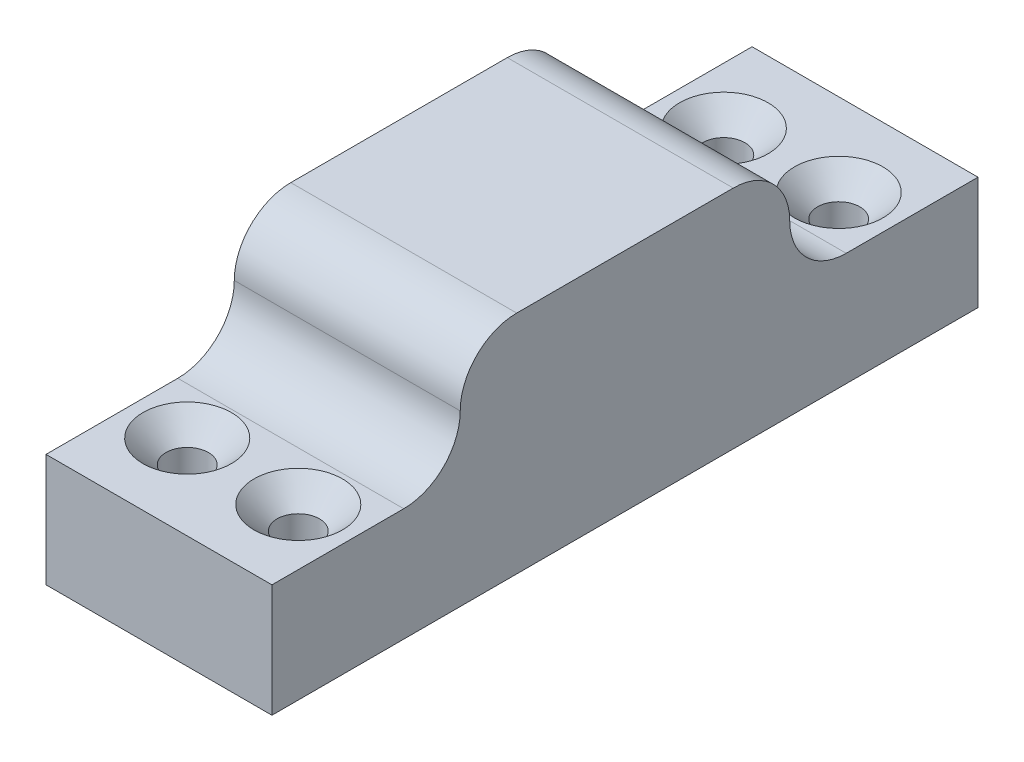
ISO-10303-21;
HEADER;
FILE_DESCRIPTION(('STEP AP214'),'2;1');
FILE_NAME('part.step','',(''),(''),'','','');
FILE_SCHEMA(('AUTOMOTIVE_DESIGN { 1 0 10303 214 1 1 1 1 }'));
ENDSEC;
DATA;
#1=APPLICATION_CONTEXT('core data for automotive mechanical design processes');
#2=APPLICATION_PROTOCOL_DEFINITION('international standard','automotive_design',2000,#1);
#3=PRODUCT_CONTEXT('',#1,'mechanical');
#4=PRODUCT('Part','Part','',(#3));
#5=PRODUCT_RELATED_PRODUCT_CATEGORY('part','',(#4));
#6=PRODUCT_DEFINITION_FORMATION('','',#4);
#7=PRODUCT_DEFINITION_CONTEXT('part definition',#1,'design');
#8=PRODUCT_DEFINITION('design','',#6,#7);
#9=PRODUCT_DEFINITION_SHAPE('','',#8);
#10=(LENGTH_UNIT() NAMED_UNIT(*) SI_UNIT(.MILLI.,.METRE.));
#11=(NAMED_UNIT(*) PLANE_ANGLE_UNIT() SI_UNIT($,.RADIAN.));
#12=(NAMED_UNIT(*) SI_UNIT($,.STERADIAN.) SOLID_ANGLE_UNIT());
#13=UNCERTAINTY_MEASURE_WITH_UNIT(LENGTH_MEASURE(1.E-05),#10,'distance_accuracy_value','');
#14=(GEOMETRIC_REPRESENTATION_CONTEXT(3) GLOBAL_UNCERTAINTY_ASSIGNED_CONTEXT((#13)) GLOBAL_UNIT_ASSIGNED_CONTEXT((#10,
#11,#12)) REPRESENTATION_CONTEXT('',''));
#15=CARTESIAN_POINT('',(0.,0.,0.));
#16=DIRECTION('',(0.,0.,1.));
#17=DIRECTION('',(1.,0.,0.));
#18=AXIS2_PLACEMENT_3D('',#15,#16,#17);
#19=CARTESIAN_POINT('',(24.,11.9999999999999,-37.4999999999996));
#20=DIRECTION('',(0.,0.,1.));
#21=DIRECTION('',(1.,0.,0.));
#22=AXIS2_PLACEMENT_3D('',#19,#20,#21);
#23=PLANE('',#22);
#24=DIRECTION('',(1.,0.,0.));
#25=VECTOR('',#24,1.);
#26=CARTESIAN_POINT('',(0.,-1.40512601554121E-13,-37.5000000000001));
#27=LINE('',#26,#25);
#28=CARTESIAN_POINT('',(0.,-1.40512601554121E-13,-37.5000000000001));
#29=VERTEX_POINT('',#28);
#30=CARTESIAN_POINT('',(24.,-1.40512601554121E-13,-37.5000000000001));
#31=VERTEX_POINT('',#30);
#32=EDGE_CURVE('E107',#29,#31,#27,.T.);
#33=ORIENTED_EDGE('',*,*,#32,.T.);
#34=DIRECTION('',(0.,1.,0.));
#35=VECTOR('',#34,1.);
#36=CARTESIAN_POINT('',(24.,11.9999999999999,-37.4999999999996));
#37=LINE('',#36,#35);
#38=CARTESIAN_POINT('',(24.,-12.0000000000001,-37.4999999999996));
#39=VERTEX_POINT('',#38);
#40=EDGE_CURVE('E211',#39,#31,#37,.T.);
#41=ORIENTED_EDGE('',*,*,#40,.F.);
#42=DIRECTION('',(-1.,0.,0.));
#43=VECTOR('',#42,1.);
#44=CARTESIAN_POINT('',(24.,-12.0000000000001,-37.4999999999996));
#45=LINE('',#44,#43);
#46=CARTESIAN_POINT('',(0.,-12.0000000000001,-37.4999999999996));
#47=VERTEX_POINT('',#46);
#48=EDGE_CURVE('E126',#39,#47,#45,.T.);
#49=ORIENTED_EDGE('',*,*,#48,.T.);
#50=DIRECTION('',(0.,1.,0.));
#51=VECTOR('',#50,1.);
#52=CARTESIAN_POINT('',(0.,11.9999999999999,-37.4999999999996));
#53=LINE('',#52,#51);
#54=EDGE_CURVE('E122',#47,#29,#53,.T.);
#55=ORIENTED_EDGE('',*,*,#54,.T.);
#56=EDGE_LOOP('',(#33,#41,#49,#55));
#57=FACE_BOUND('',#56,.T.);
#58=ADVANCED_FACE('F33',(#57),#23,.F.);
#59=CARTESIAN_POINT('',(24.,11.9999999999999,-37.4999999999996));
#60=DIRECTION('',(0.,-1.,0.));
#61=DIRECTION('',(0.,0.,-1.));
#62=AXIS2_PLACEMENT_3D('',#59,#60,#61);
#63=PLANE('',#62);
#64=DIRECTION('',(0.,0.,1.));
#65=VECTOR('',#64,1.);
#66=CARTESIAN_POINT('',(24.,11.9999999999999,-37.4999999999996));
#67=LINE('',#66,#65);
#68=CARTESIAN_POINT('',(24.,11.9999999999999,-11.5000000000001));
#69=VERTEX_POINT('',#68);
#70=CARTESIAN_POINT('',(24.,11.9999999999999,11.5000000000001));
#71=VERTEX_POINT('',#70);
#72=EDGE_CURVE('E138',#69,#71,#67,.T.);
#73=ORIENTED_EDGE('',*,*,#72,.F.);
#74=DIRECTION('',(1.,0.,0.));
#75=VECTOR('',#74,1.);
#76=CARTESIAN_POINT('',(0.,11.9999999999999,-11.5000000000001));
#77=LINE('',#76,#75);
#78=CARTESIAN_POINT('',(0.,11.9999999999999,-11.5000000000001));
#79=VERTEX_POINT('',#78);
#80=EDGE_CURVE('E162',#69,#79,#77,.F.);
#81=ORIENTED_EDGE('',*,*,#80,.T.);
#82=DIRECTION('',(0.,0.,1.));
#83=VECTOR('',#82,1.);
#84=CARTESIAN_POINT('',(0.,11.9999999999999,-37.4999999999996));
#85=LINE('',#84,#83);
#86=CARTESIAN_POINT('',(0.,11.9999999999999,11.5000000000001));
#87=VERTEX_POINT('',#86);
#88=EDGE_CURVE('E127',#79,#87,#85,.T.);
#89=ORIENTED_EDGE('',*,*,#88,.T.);
#90=DIRECTION('',(1.,0.,0.));
#91=VECTOR('',#90,1.);
#92=CARTESIAN_POINT('',(24.,11.9999999999999,11.5000000000001));
#93=LINE('',#92,#91);
#94=EDGE_CURVE('E141',#87,#71,#93,.T.);
#95=ORIENTED_EDGE('',*,*,#94,.T.);
#96=EDGE_LOOP('',(#73,#81,#89,#95));
#97=FACE_BOUND('',#96,.T.);
#98=ADVANCED_FACE('F181',(#97),#63,.F.);
#99=CARTESIAN_POINT('',(24.,0.,0.));
#100=DIRECTION('',(-1.,0.,0.));
#101=DIRECTION('',(0.,0.,1.));
#102=AXIS2_PLACEMENT_3D('',#99,#100,#101);
#103=PLANE('',#102);
#104=DIRECTION('',(0.,0.,1.));
#105=VECTOR('',#104,1.);
#106=CARTESIAN_POINT('',(24.,-1.40512601554121E-13,-37.5000000000001));
#107=LINE('',#106,#105);
#108=CARTESIAN_POINT('',(24.,0.,-23.5));
#109=VERTEX_POINT('',#108);
#110=EDGE_CURVE('E112',#31,#109,#107,.T.);
#111=ORIENTED_EDGE('',*,*,#110,.T.);
#112=CARTESIAN_POINT('',(24.,5.99999999999996,-23.5000000000001));
#113=DIRECTION('',(-1.,0.,0.));
#114=DIRECTION('',(0.,0.,1.));
#115=AXIS2_PLACEMENT_3D('',#112,#113,#114);
#116=CIRCLE('',#115,6.);
#117=CARTESIAN_POINT('',(24.,5.99999999999987,-17.5000000000001));
#118=VERTEX_POINT('',#117);
#119=EDGE_CURVE('E42',#109,#118,#116,.T.);
#120=ORIENTED_EDGE('',*,*,#119,.T.);
#121=CARTESIAN_POINT('',(24.,5.99999999999987,-11.5000000000001));
#122=DIRECTION('',(-1.,0.,0.));
#123=DIRECTION('',(0.,0.,1.));
#124=AXIS2_PLACEMENT_3D('',#121,#122,#123);
#125=CIRCLE('',#124,6.);
#126=EDGE_CURVE('E155',#118,#69,#125,.F.);
#127=ORIENTED_EDGE('',*,*,#126,.T.);
#128=ORIENTED_EDGE('',*,*,#72,.T.);
#129=CARTESIAN_POINT('',(24.,5.99999999999986,11.5000000000001));
#130=DIRECTION('',(-1.,0.,0.));
#131=DIRECTION('',(0.,0.,1.));
#132=AXIS2_PLACEMENT_3D('',#129,#130,#131);
#133=CIRCLE('',#132,6.);
#134=CARTESIAN_POINT('',(24.,5.99999999999986,17.5000000000001));
#135=VERTEX_POINT('',#134);
#136=EDGE_CURVE('E144',#71,#135,#133,.F.);
#137=ORIENTED_EDGE('',*,*,#136,.T.);
#138=CARTESIAN_POINT('',(24.,5.99999999999996,23.5000000000001));
#139=DIRECTION('',(-1.,0.,0.));
#140=DIRECTION('',(0.,0.,1.));
#141=AXIS2_PLACEMENT_3D('',#138,#139,#140);
#142=CIRCLE('',#141,6.);
#143=CARTESIAN_POINT('',(24.,0.,23.5));
#144=VERTEX_POINT('',#143);
#145=EDGE_CURVE('E151',#135,#144,#142,.T.);
#146=ORIENTED_EDGE('',*,*,#145,.T.);
#147=DIRECTION('',(0.,0.,-1.));
#148=VECTOR('',#147,1.);
#149=CARTESIAN_POINT('',(24.,-1.40512601554121E-13,37.5000000000001));
#150=LINE('',#149,#148);
#151=CARTESIAN_POINT('',(24.,-1.40512601554121E-13,37.5000000000001));
#152=VERTEX_POINT('',#151);
#153=EDGE_CURVE('E159',#152,#144,#150,.T.);
#154=ORIENTED_EDGE('',*,*,#153,.F.);
#155=DIRECTION('',(0.,-1.,0.));
#156=VECTOR('',#155,1.);
#157=CARTESIAN_POINT('',(24.,11.9999999999999,37.5000000000001));
#158=LINE('',#157,#156);
#159=CARTESIAN_POINT('',(24.,-12.0000000000001,37.5000000000001));
#160=VERTEX_POINT('',#159);
#161=EDGE_CURVE('E130',#152,#160,#158,.T.);
#162=ORIENTED_EDGE('',*,*,#161,.T.);
#163=DIRECTION('',(0.,0.,-1.));
#164=VECTOR('',#163,1.);
#165=CARTESIAN_POINT('',(24.,-12.0000000000001,-37.4999999999996));
#166=LINE('',#165,#164);
#167=EDGE_CURVE('E209',#160,#39,#166,.T.);
#168=ORIENTED_EDGE('',*,*,#167,.T.);
#169=ORIENTED_EDGE('',*,*,#40,.T.);
#170=EDGE_LOOP('',(#111,#120,#127,#128,#137,#146,#154,#162,#168,#169));
#171=FACE_BOUND('',#170,.T.);
#172=ADVANCED_FACE('F171',(#171),#103,.F.);
#173=CARTESIAN_POINT('',(0.,0.,0.));
#174=DIRECTION('',(-1.,0.,0.));
#175=DIRECTION('',(0.,0.,1.));
#176=AXIS2_PLACEMENT_3D('',#173,#174,#175);
#177=PLANE('',#176);
#178=ORIENTED_EDGE('',*,*,#88,.F.);
#179=CARTESIAN_POINT('',(0.,5.99999999999987,-11.5000000000001));
#180=DIRECTION('',(-1.,0.,0.));
#181=DIRECTION('',(0.,0.,1.));
#182=AXIS2_PLACEMENT_3D('',#179,#180,#181);
#183=CIRCLE('',#182,6.);
#184=CARTESIAN_POINT('',(0.,5.99999999999987,-17.5000000000001));
#185=VERTEX_POINT('',#184);
#186=EDGE_CURVE('E52',#79,#185,#183,.T.);
#187=ORIENTED_EDGE('',*,*,#186,.T.);
#188=CARTESIAN_POINT('',(0.,5.99999999999996,-23.5000000000001));
#189=DIRECTION('',(-1.,0.,0.));
#190=DIRECTION('',(0.,0.,1.));
#191=AXIS2_PLACEMENT_3D('',#188,#189,#190);
#192=CIRCLE('',#191,6.);
#193=CARTESIAN_POINT('',(0.,0.,-23.5));
#194=VERTEX_POINT('',#193);
#195=EDGE_CURVE('E11',#185,#194,#192,.F.);
#196=ORIENTED_EDGE('',*,*,#195,.T.);
#197=DIRECTION('',(0.,0.,1.));
#198=VECTOR('',#197,1.);
#199=CARTESIAN_POINT('',(0.,-1.40512601554121E-13,-37.5000000000001));
#200=LINE('',#199,#198);
#201=EDGE_CURVE('E109',#29,#194,#200,.T.);
#202=ORIENTED_EDGE('',*,*,#201,.F.);
#203=ORIENTED_EDGE('',*,*,#54,.F.);
#204=DIRECTION('',(0.,0.,-1.));
#205=VECTOR('',#204,1.);
#206=CARTESIAN_POINT('',(0.,-12.0000000000001,-37.4999999999996));
#207=LINE('',#206,#205);
#208=CARTESIAN_POINT('',(0.,-12.0000000000001,37.5000000000001));
#209=VERTEX_POINT('',#208);
#210=EDGE_CURVE('E128',#209,#47,#207,.T.);
#211=ORIENTED_EDGE('',*,*,#210,.F.);
#212=DIRECTION('',(0.,-1.,0.));
#213=VECTOR('',#212,1.);
#214=CARTESIAN_POINT('',(0.,11.9999999999999,37.5000000000001));
#215=LINE('',#214,#213);
#216=CARTESIAN_POINT('',(0.,-1.40512601554121E-13,37.5000000000001));
#217=VERTEX_POINT('',#216);
#218=EDGE_CURVE('E132',#217,#209,#215,.T.);
#219=ORIENTED_EDGE('',*,*,#218,.F.);
#220=DIRECTION('',(0.,0.,-1.));
#221=VECTOR('',#220,1.);
#222=CARTESIAN_POINT('',(0.,-1.40512601554121E-13,37.5000000000001));
#223=LINE('',#222,#221);
#224=CARTESIAN_POINT('',(0.,0.,23.5));
#225=VERTEX_POINT('',#224);
#226=EDGE_CURVE('E198',#217,#225,#223,.T.);
#227=ORIENTED_EDGE('',*,*,#226,.T.);
#228=CARTESIAN_POINT('',(0.,5.99999999999996,23.5000000000001));
#229=DIRECTION('',(-1.,0.,0.));
#230=DIRECTION('',(0.,0.,1.));
#231=AXIS2_PLACEMENT_3D('',#228,#229,#230);
#232=CIRCLE('',#231,6.);
#233=CARTESIAN_POINT('',(0.,5.99999999999986,17.5000000000001));
#234=VERTEX_POINT('',#233);
#235=EDGE_CURVE('E153',#225,#234,#232,.F.);
#236=ORIENTED_EDGE('',*,*,#235,.T.);
#237=CARTESIAN_POINT('',(0.,5.99999999999986,11.5000000000001));
#238=DIRECTION('',(-1.,0.,0.));
#239=DIRECTION('',(0.,0.,1.));
#240=AXIS2_PLACEMENT_3D('',#237,#238,#239);
#241=CIRCLE('',#240,6.);
#242=EDGE_CURVE('E146',#234,#87,#241,.T.);
#243=ORIENTED_EDGE('',*,*,#242,.T.);
#244=EDGE_LOOP('',(#178,#187,#196,#202,#203,#211,#219,#227,#236,#243));
#245=FACE_BOUND('',#244,.T.);
#246=ADVANCED_FACE('F120',(#245),#177,.T.);
#247=CARTESIAN_POINT('',(24.,11.9999999999999,37.5000000000001));
#248=DIRECTION('',(0.,0.,-1.));
#249=DIRECTION('',(-1.,0.,0.));
#250=AXIS2_PLACEMENT_3D('',#247,#248,#249);
#251=PLANE('',#250);
#252=ORIENTED_EDGE('',*,*,#161,.F.);
#253=DIRECTION('',(1.,0.,0.));
#254=VECTOR('',#253,1.);
#255=CARTESIAN_POINT('',(0.,-1.40512601554121E-13,37.5000000000001));
#256=LINE('',#255,#254);
#257=EDGE_CURVE('E201',#217,#152,#256,.T.);
#258=ORIENTED_EDGE('',*,*,#257,.F.);
#259=ORIENTED_EDGE('',*,*,#218,.T.);
#260=DIRECTION('',(-1.,0.,0.));
#261=VECTOR('',#260,1.);
#262=CARTESIAN_POINT('',(24.,-12.0000000000001,37.5000000000001));
#263=LINE('',#262,#261);
#264=EDGE_CURVE('E137',#160,#209,#263,.T.);
#265=ORIENTED_EDGE('',*,*,#264,.F.);
#266=EDGE_LOOP('',(#252,#258,#259,#265));
#267=FACE_BOUND('',#266,.T.);
#268=ADVANCED_FACE('F216',(#267),#251,.F.);
#269=CARTESIAN_POINT('',(24.,-12.0000000000001,-37.4999999999996));
#270=DIRECTION('',(0.,1.,0.));
#271=DIRECTION('',(0.,0.,1.));
#272=AXIS2_PLACEMENT_3D('',#269,#270,#271);
#273=PLANE('',#272);
#274=CARTESIAN_POINT('',(6.,-12.0000000000006,-28.5));
#275=DIRECTION('',(0.,1.,0.));
#276=DIRECTION('',(0.,0.,1.));
#277=AXIS2_PLACEMENT_3D('',#274,#275,#276);
#278=CIRCLE('',#277,2.25);
#279=CARTESIAN_POINT('',(6.,-12.0000000000006,-26.25));
#280=VERTEX_POINT('',#279);
#281=EDGE_CURVE('E287',#280,#280,#278,.T.);
#282=ORIENTED_EDGE('',*,*,#281,.T.);
#283=EDGE_LOOP('',(#282));
#284=FACE_BOUND('',#283,.T.);
#285=CARTESIAN_POINT('',(18.,-12.0000000000006,-28.7024893433951));
#286=DIRECTION('',(0.,1.,0.));
#287=DIRECTION('',(0.,0.,1.));
#288=AXIS2_PLACEMENT_3D('',#285,#286,#287);
#289=CIRCLE('',#288,2.25);
#290=CARTESIAN_POINT('',(18.,-12.0000000000006,-26.4524893433951));
#291=VERTEX_POINT('',#290);
#292=EDGE_CURVE('E177',#291,#291,#289,.T.);
#293=ORIENTED_EDGE('',*,*,#292,.T.);
#294=EDGE_LOOP('',(#293));
#295=FACE_BOUND('',#294,.T.);
#296=CARTESIAN_POINT('',(6.,-12.0000000000006,28.5));
#297=DIRECTION('',(0.,1.,0.));
#298=DIRECTION('',(0.,0.,1.));
#299=AXIS2_PLACEMENT_3D('',#296,#297,#298);
#300=CIRCLE('',#299,2.25);
#301=CARTESIAN_POINT('',(6.,-12.0000000000006,30.75));
#302=VERTEX_POINT('',#301);
#303=EDGE_CURVE('E305',#302,#302,#300,.T.);
#304=ORIENTED_EDGE('',*,*,#303,.T.);
#305=EDGE_LOOP('',(#304));
#306=FACE_BOUND('',#305,.T.);
#307=CARTESIAN_POINT('',(18.,-12.0000000000006,28.7024893433951));
#308=DIRECTION('',(0.,1.,0.));
#309=DIRECTION('',(0.,0.,1.));
#310=AXIS2_PLACEMENT_3D('',#307,#308,#309);
#311=CIRCLE('',#310,2.25);
#312=CARTESIAN_POINT('',(18.,-12.0000000000006,30.9524893433951));
#313=VERTEX_POINT('',#312);
#314=EDGE_CURVE('E160',#313,#313,#311,.T.);
#315=ORIENTED_EDGE('',*,*,#314,.T.);
#316=EDGE_LOOP('',(#315));
#317=FACE_BOUND('',#316,.T.);
#318=ORIENTED_EDGE('',*,*,#210,.T.);
#319=ORIENTED_EDGE('',*,*,#48,.F.);
#320=ORIENTED_EDGE('',*,*,#167,.F.);
#321=ORIENTED_EDGE('',*,*,#264,.T.);
#322=EDGE_LOOP('',(#318,#319,#320,#321));
#323=FACE_BOUND('',#322,.T.);
#324=ADVANCED_FACE('F219',(#284,#295,#306,#317,#323),#273,.F.);
#325=CARTESIAN_POINT('',(0.,-1.40512601554121E-13,37.5000000000001));
#326=DIRECTION('',(0.,-1.,0.));
#327=DIRECTION('',(0.,0.,-1.));
#328=AXIS2_PLACEMENT_3D('',#325,#326,#327);
#329=PLANE('',#328);
#330=CARTESIAN_POINT('',(6.,-2.00230457214624E-13,28.5000000000001));
#331=DIRECTION('',(0.,1.,0.));
#332=DIRECTION('',(0.,0.,1.));
#333=AXIS2_PLACEMENT_3D('',#330,#331,#332);
#334=CIRCLE('',#333,4.7);
#335=CARTESIAN_POINT('',(6.,-2.33250918579842E-13,33.2000000000001));
#336=VERTEX_POINT('',#335);
#337=EDGE_CURVE('E117',#336,#336,#334,.T.);
#338=ORIENTED_EDGE('',*,*,#337,.F.);
#339=EDGE_LOOP('',(#338));
#340=FACE_BOUND('',#339,.T.);
#341=CARTESIAN_POINT('',(18.,-2.01653072435995E-13,28.7024893433951));
#342=DIRECTION('',(0.,1.,0.));
#343=DIRECTION('',(0.,0.,1.));
#344=AXIS2_PLACEMENT_3D('',#341,#342,#343);
#345=CIRCLE('',#344,4.7);
#346=CARTESIAN_POINT('',(18.,-2.34673533801213E-13,33.4024893433951));
#347=VERTEX_POINT('',#346);
#348=EDGE_CURVE('E308',#347,#347,#345,.T.);
#349=ORIENTED_EDGE('',*,*,#348,.F.);
#350=EDGE_LOOP('',(#349));
#351=FACE_BOUND('',#350,.T.);
#352=ORIENTED_EDGE('',*,*,#153,.T.);
#353=DIRECTION('',(1.,0.,0.));
#354=VECTOR('',#353,1.);
#355=CARTESIAN_POINT('',(0.,0.,23.5));
#356=LINE('',#355,#354);
#357=EDGE_CURVE('E149',#144,#225,#356,.F.);
#358=ORIENTED_EDGE('',*,*,#357,.T.);
#359=ORIENTED_EDGE('',*,*,#226,.F.);
#360=ORIENTED_EDGE('',*,*,#257,.T.);
#361=EDGE_LOOP('',(#352,#358,#359,#360));
#362=FACE_BOUND('',#361,.T.);
#363=ADVANCED_FACE('F197',(#340,#351,#362),#329,.F.);
#364=CARTESIAN_POINT('',(0.,5.99999999999996,23.5000000000001));
#365=DIRECTION('',(-1.,0.,0.));
#366=DIRECTION('',(0.,0.,1.));
#367=AXIS2_PLACEMENT_3D('',#364,#365,#366);
#368=CYLINDRICAL_SURFACE('',#367,6.);
#369=DIRECTION('',(1.,0.,0.));
#370=VECTOR('',#369,1.);
#371=CARTESIAN_POINT('',(24.,5.99999999999996,17.5000000000001));
#372=LINE('',#371,#370);
#373=EDGE_CURVE('E156',#234,#135,#372,.T.);
#374=ORIENTED_EDGE('',*,*,#373,.F.);
#375=ORIENTED_EDGE('',*,*,#235,.F.);
#376=ORIENTED_EDGE('',*,*,#357,.F.);
#377=ORIENTED_EDGE('',*,*,#145,.F.);
#378=EDGE_LOOP('',(#374,#375,#376,#377));
#379=FACE_BOUND('',#378,.T.);
#380=ADVANCED_FACE('F195',(#379),#368,.F.);
#381=CARTESIAN_POINT('',(24.,5.99999999999986,11.5000000000001));
#382=DIRECTION('',(1.,0.,0.));
#383=DIRECTION('',(0.,0.,-1.));
#384=AXIS2_PLACEMENT_3D('',#381,#382,#383);
#385=CYLINDRICAL_SURFACE('',#384,6.);
#386=ORIENTED_EDGE('',*,*,#242,.F.);
#387=ORIENTED_EDGE('',*,*,#373,.T.);
#388=ORIENTED_EDGE('',*,*,#136,.F.);
#389=ORIENTED_EDGE('',*,*,#94,.F.);
#390=EDGE_LOOP('',(#386,#387,#388,#389));
#391=FACE_BOUND('',#390,.T.);
#392=ADVANCED_FACE('F189',(#391),#385,.T.);
#393=CARTESIAN_POINT('',(18.,-2.01653072435995E-13,28.7024893433951));
#394=DIRECTION('',(0.,1.,0.));
#395=DIRECTION('',(0.,0.,1.));
#396=AXIS2_PLACEMENT_3D('',#393,#394,#395);
#397=CYLINDRICAL_SURFACE('',#396,2.25);
#398=ORIENTED_EDGE('',*,*,#314,.F.);
#399=EDGE_LOOP('',(#398));
#400=FACE_BOUND('',#399,.T.);
#401=CARTESIAN_POINT('',(18.,-2.4500000000002,28.7024893433951));
#402=DIRECTION('',(0.,1.,0.));
#403=DIRECTION('',(0.,0.,1.));
#404=AXIS2_PLACEMENT_3D('',#401,#402,#403);
#405=CIRCLE('',#404,2.25);
#406=CARTESIAN_POINT('',(18.,-2.45000000000022,30.9524893433951));
#407=VERTEX_POINT('',#406);
#408=EDGE_CURVE('E310',#407,#407,#405,.T.);
#409=ORIENTED_EDGE('',*,*,#408,.T.);
#410=EDGE_LOOP('',(#409));
#411=FACE_BOUND('',#410,.T.);
#412=ADVANCED_FACE('F243',(#400,#411),#397,.F.);
#413=CARTESIAN_POINT('',(18.,-2.01653072435995E-13,28.7024893433951));
#414=DIRECTION('',(0.,1.,0.));
#415=DIRECTION('',(0.,0.,1.));
#416=AXIS2_PLACEMENT_3D('',#413,#414,#415);
#417=CONICAL_SURFACE('',#416,4.7,0.785398163397449);
#418=ORIENTED_EDGE('',*,*,#408,.F.);
#419=EDGE_LOOP('',(#418));
#420=FACE_BOUND('',#419,.T.);
#421=ORIENTED_EDGE('',*,*,#348,.T.);
#422=EDGE_LOOP('',(#421));
#423=FACE_BOUND('',#422,.T.);
#424=ADVANCED_FACE('F246',(#420,#423),#417,.F.);
#425=CARTESIAN_POINT('',(6.,-2.00230457214624E-13,28.5000000000001));
#426=DIRECTION('',(0.,1.,0.));
#427=DIRECTION('',(0.,0.,1.));
#428=AXIS2_PLACEMENT_3D('',#425,#426,#427);
#429=CYLINDRICAL_SURFACE('',#428,2.25);
#430=ORIENTED_EDGE('',*,*,#303,.F.);
#431=EDGE_LOOP('',(#430));
#432=FACE_BOUND('',#431,.T.);
#433=CARTESIAN_POINT('',(6.,-2.4500000000002,28.5000000000001));
#434=DIRECTION('',(0.,1.,0.));
#435=DIRECTION('',(0.,0.,1.));
#436=AXIS2_PLACEMENT_3D('',#433,#434,#435);
#437=CIRCLE('',#436,2.25);
#438=CARTESIAN_POINT('',(6.,-2.45000000000022,30.7500000000001));
#439=VERTEX_POINT('',#438);
#440=EDGE_CURVE('E302',#439,#439,#437,.T.);
#441=ORIENTED_EDGE('',*,*,#440,.T.);
#442=EDGE_LOOP('',(#441));
#443=FACE_BOUND('',#442,.T.);
#444=ADVANCED_FACE('F250',(#432,#443),#429,.F.);
#445=CARTESIAN_POINT('',(6.,-2.00230457214624E-13,28.5000000000001));
#446=DIRECTION('',(0.,1.,0.));
#447=DIRECTION('',(0.,0.,1.));
#448=AXIS2_PLACEMENT_3D('',#445,#446,#447);
#449=CONICAL_SURFACE('',#448,4.7,0.785398163397449);
#450=ORIENTED_EDGE('',*,*,#440,.F.);
#451=EDGE_LOOP('',(#450));
#452=FACE_BOUND('',#451,.T.);
#453=ORIENTED_EDGE('',*,*,#337,.T.);
#454=EDGE_LOOP('',(#453));
#455=FACE_BOUND('',#454,.T.);
#456=ADVANCED_FACE('F254',(#452,#455),#449,.F.);
#457=CARTESIAN_POINT('',(0.,-1.40512601554121E-13,-37.5000000000001));
#458=DIRECTION('',(0.,1.,0.));
#459=DIRECTION('',(0.,0.,1.));
#460=AXIS2_PLACEMENT_3D('',#457,#458,#459);
#461=PLANE('',#460);
#462=CARTESIAN_POINT('',(6.,-2.00230457214624E-13,-28.5000000000001));
#463=DIRECTION('',(0.,1.,0.));
#464=DIRECTION('',(0.,0.,1.));
#465=AXIS2_PLACEMENT_3D('',#462,#463,#464);
#466=CIRCLE('',#465,4.7);
#467=CARTESIAN_POINT('',(6.,-1.67209995849405E-13,-23.8000000000001));
#468=VERTEX_POINT('',#467);
#469=EDGE_CURVE('E285',#468,#468,#466,.T.);
#470=ORIENTED_EDGE('',*,*,#469,.F.);
#471=EDGE_LOOP('',(#470));
#472=FACE_BOUND('',#471,.T.);
#473=CARTESIAN_POINT('',(18.,-2.01653072435995E-13,-28.7024893433951));
#474=DIRECTION('',(0.,1.,0.));
#475=DIRECTION('',(0.,0.,1.));
#476=AXIS2_PLACEMENT_3D('',#473,#474,#475);
#477=CIRCLE('',#476,4.7);
#478=CARTESIAN_POINT('',(18.,-1.68632611070776E-13,-24.0024893433951));
#479=VERTEX_POINT('',#478);
#480=EDGE_CURVE('E291',#479,#479,#477,.T.);
#481=ORIENTED_EDGE('',*,*,#480,.F.);
#482=EDGE_LOOP('',(#481));
#483=FACE_BOUND('',#482,.T.);
#484=ORIENTED_EDGE('',*,*,#201,.T.);
#485=DIRECTION('',(1.,0.,0.));
#486=VECTOR('',#485,1.);
#487=CARTESIAN_POINT('',(24.,0.,-23.5));
#488=LINE('',#487,#486);
#489=EDGE_CURVE('E166',#194,#109,#488,.T.);
#490=ORIENTED_EDGE('',*,*,#489,.T.);
#491=ORIENTED_EDGE('',*,*,#110,.F.);
#492=ORIENTED_EDGE('',*,*,#32,.F.);
#493=EDGE_LOOP('',(#484,#490,#491,#492));
#494=FACE_BOUND('',#493,.T.);
#495=ADVANCED_FACE('F108',(#472,#483,#494),#461,.T.);
#496=CARTESIAN_POINT('',(0.,5.99999999999996,-23.5000000000001));
#497=DIRECTION('',(-1.,0.,0.));
#498=DIRECTION('',(0.,0.,1.));
#499=AXIS2_PLACEMENT_3D('',#496,#497,#498);
#500=CYLINDRICAL_SURFACE('',#499,6.);
#501=ORIENTED_EDGE('',*,*,#489,.F.);
#502=ORIENTED_EDGE('',*,*,#195,.F.);
#503=DIRECTION('',(1.,0.,0.));
#504=VECTOR('',#503,1.);
#505=CARTESIAN_POINT('',(0.,5.99999999999996,-17.5000000000001));
#506=LINE('',#505,#504);
#507=EDGE_CURVE('E37',#118,#185,#506,.F.);
#508=ORIENTED_EDGE('',*,*,#507,.F.);
#509=ORIENTED_EDGE('',*,*,#119,.F.);
#510=EDGE_LOOP('',(#501,#502,#508,#509));
#511=FACE_BOUND('',#510,.T.);
#512=ADVANCED_FACE('F35',(#511),#500,.F.);
#513=CARTESIAN_POINT('',(0.,5.99999999999987,-11.5000000000001));
#514=DIRECTION('',(-1.,0.,0.));
#515=DIRECTION('',(0.,0.,1.));
#516=AXIS2_PLACEMENT_3D('',#513,#514,#515);
#517=CYLINDRICAL_SURFACE('',#516,6.);
#518=ORIENTED_EDGE('',*,*,#186,.F.);
#519=ORIENTED_EDGE('',*,*,#80,.F.);
#520=ORIENTED_EDGE('',*,*,#126,.F.);
#521=ORIENTED_EDGE('',*,*,#507,.T.);
#522=EDGE_LOOP('',(#518,#519,#520,#521));
#523=FACE_BOUND('',#522,.T.);
#524=ADVANCED_FACE('F179',(#523),#517,.T.);
#525=CARTESIAN_POINT('',(18.,-2.01653072435995E-13,-28.7024893433951));
#526=DIRECTION('',(0.,1.,0.));
#527=DIRECTION('',(0.,0.,1.));
#528=AXIS2_PLACEMENT_3D('',#525,#526,#527);
#529=CYLINDRICAL_SURFACE('',#528,2.25);
#530=ORIENTED_EDGE('',*,*,#292,.F.);
#531=EDGE_LOOP('',(#530));
#532=FACE_BOUND('',#531,.T.);
#533=CARTESIAN_POINT('',(18.,-2.4500000000002,-28.7024893433951));
#534=DIRECTION('',(0.,1.,0.));
#535=DIRECTION('',(0.,0.,1.));
#536=AXIS2_PLACEMENT_3D('',#533,#534,#535);
#537=CIRCLE('',#536,2.25);
#538=CARTESIAN_POINT('',(18.,-2.45000000000018,-26.4524893433951));
#539=VERTEX_POINT('',#538);
#540=EDGE_CURVE('E294',#539,#539,#537,.T.);
#541=ORIENTED_EDGE('',*,*,#540,.T.);
#542=EDGE_LOOP('',(#541));
#543=FACE_BOUND('',#542,.T.);
#544=ADVANCED_FACE('F262',(#532,#543),#529,.F.);
#545=CARTESIAN_POINT('',(18.,-2.01653072435995E-13,-28.7024893433951));
#546=DIRECTION('',(0.,1.,0.));
#547=DIRECTION('',(0.,0.,1.));
#548=AXIS2_PLACEMENT_3D('',#545,#546,#547);
#549=CONICAL_SURFACE('',#548,4.7,0.785398163397449);
#550=ORIENTED_EDGE('',*,*,#540,.F.);
#551=EDGE_LOOP('',(#550));
#552=FACE_BOUND('',#551,.T.);
#553=ORIENTED_EDGE('',*,*,#480,.T.);
#554=EDGE_LOOP('',(#553));
#555=FACE_BOUND('',#554,.T.);
#556=ADVANCED_FACE('F265',(#552,#555),#549,.F.);
#557=CARTESIAN_POINT('',(6.,-2.00230457214624E-13,-28.5000000000001));
#558=DIRECTION('',(0.,1.,0.));
#559=DIRECTION('',(0.,0.,1.));
#560=AXIS2_PLACEMENT_3D('',#557,#558,#559);
#561=CYLINDRICAL_SURFACE('',#560,2.25);
#562=ORIENTED_EDGE('',*,*,#281,.F.);
#563=EDGE_LOOP('',(#562));
#564=FACE_BOUND('',#563,.T.);
#565=CARTESIAN_POINT('',(6.,-2.4500000000002,-28.5000000000001));
#566=DIRECTION('',(0.,1.,0.));
#567=DIRECTION('',(0.,0.,1.));
#568=AXIS2_PLACEMENT_3D('',#565,#566,#567);
#569=CIRCLE('',#568,2.25);
#570=CARTESIAN_POINT('',(6.,-2.45000000000018,-26.2500000000001));
#571=VERTEX_POINT('',#570);
#572=EDGE_CURVE('E282',#571,#571,#569,.T.);
#573=ORIENTED_EDGE('',*,*,#572,.T.);
#574=EDGE_LOOP('',(#573));
#575=FACE_BOUND('',#574,.T.);
#576=ADVANCED_FACE('F269',(#564,#575),#561,.F.);
#577=CARTESIAN_POINT('',(6.,-2.00230457214624E-13,-28.5000000000001));
#578=DIRECTION('',(0.,1.,0.));
#579=DIRECTION('',(0.,0.,1.));
#580=AXIS2_PLACEMENT_3D('',#577,#578,#579);
#581=CONICAL_SURFACE('',#580,4.7,0.785398163397449);
#582=ORIENTED_EDGE('',*,*,#572,.F.);
#583=EDGE_LOOP('',(#582));
#584=FACE_BOUND('',#583,.T.);
#585=ORIENTED_EDGE('',*,*,#469,.T.);
#586=EDGE_LOOP('',(#585));
#587=FACE_BOUND('',#586,.T.);
#588=ADVANCED_FACE('F273',(#584,#587),#581,.F.);
#589=CLOSED_SHELL('',(#58,#98,#172,#246,#268,#324,#363,#380,#392,#412,#424,#444,#456,#495,#512,
#524,#544,#556,#576,#588));
#590=MANIFOLD_SOLID_BREP('B2',#589);
#591=ADVANCED_BREP_SHAPE_REPRESENTATION('',(#18,#590),#14);
#592=SHAPE_DEFINITION_REPRESENTATION(#9,#591);
ENDSEC;
END-ISO-10303-21;
